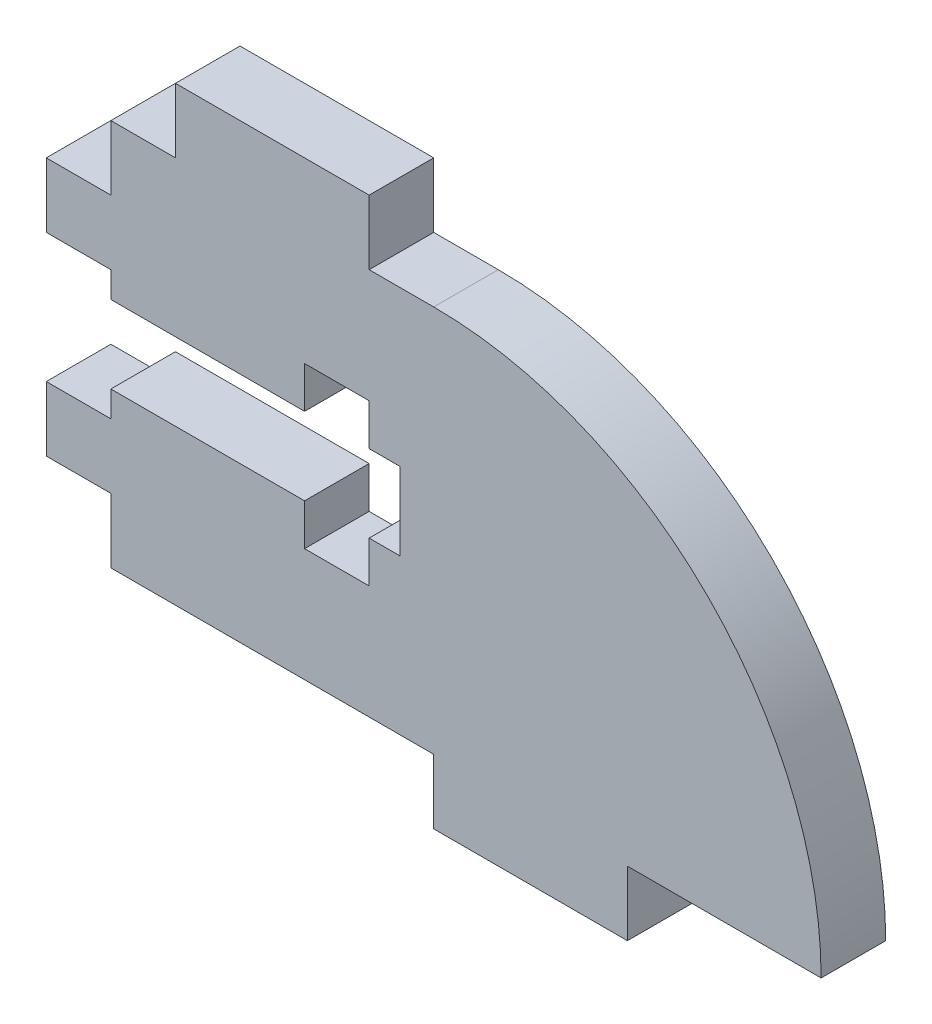
ISO-10303-21;
HEADER;
FILE_DESCRIPTION(('STEP AP214'),'2;1');
FILE_NAME('part.step','',(''),(''),'','','');
FILE_SCHEMA(('AUTOMOTIVE_DESIGN { 1 0 10303 214 1 1 1 1 }'));
ENDSEC;
DATA;
#1=APPLICATION_CONTEXT('core data for automotive mechanical design processes');
#2=APPLICATION_PROTOCOL_DEFINITION('international standard','automotive_design',2000,#1);
#3=PRODUCT_CONTEXT('',#1,'mechanical');
#4=PRODUCT('Part','Part','',(#3));
#5=PRODUCT_RELATED_PRODUCT_CATEGORY('part','',(#4));
#6=PRODUCT_DEFINITION_FORMATION('','',#4);
#7=PRODUCT_DEFINITION_CONTEXT('part definition',#1,'design');
#8=PRODUCT_DEFINITION('design','',#6,#7);
#9=PRODUCT_DEFINITION_SHAPE('','',#8);
#10=(LENGTH_UNIT() NAMED_UNIT(*) SI_UNIT(.MILLI.,.METRE.));
#11=(NAMED_UNIT(*) PLANE_ANGLE_UNIT() SI_UNIT($,.RADIAN.));
#12=(NAMED_UNIT(*) SI_UNIT($,.STERADIAN.) SOLID_ANGLE_UNIT());
#13=UNCERTAINTY_MEASURE_WITH_UNIT(LENGTH_MEASURE(1.E-05),#10,'distance_accuracy_value','');
#14=(GEOMETRIC_REPRESENTATION_CONTEXT(3) GLOBAL_UNCERTAINTY_ASSIGNED_CONTEXT((#13)) GLOBAL_UNIT_ASSIGNED_CONTEXT((#10,
#11,#12)) REPRESENTATION_CONTEXT('',''));
#15=CARTESIAN_POINT('',(0.,0.,0.));
#16=DIRECTION('',(0.,0.,1.));
#17=DIRECTION('',(1.,0.,0.));
#18=AXIS2_PLACEMENT_3D('',#15,#16,#17);
#19=CARTESIAN_POINT('',(0.,0.,3.175));
#20=DIRECTION('',(0.,1.,0.));
#21=DIRECTION('',(0.,0.,1.));
#22=AXIS2_PLACEMENT_3D('',#19,#20,#21);
#23=PLANE('',#22);
#24=DIRECTION('',(1.,0.,0.));
#25=VECTOR('',#24,1.);
#26=CARTESIAN_POINT('',(0.,0.,0.));
#27=LINE('',#26,#25);
#28=CARTESIAN_POINT('',(0.,0.,0.));
#29=VERTEX_POINT('',#28);
#30=CARTESIAN_POINT('',(15.875,0.,0.));
#31=VERTEX_POINT('',#30);
#32=EDGE_CURVE('E273',#29,#31,#27,.T.);
#33=ORIENTED_EDGE('',*,*,#32,.T.);
#34=DIRECTION('',(0.,0.,-1.));
#35=VECTOR('',#34,1.);
#36=CARTESIAN_POINT('',(15.875,0.,3.175));
#37=LINE('',#36,#35);
#38=CARTESIAN_POINT('',(15.875,0.,3.175));
#39=VERTEX_POINT('',#38);
#40=EDGE_CURVE('E11',#39,#31,#37,.T.);
#41=ORIENTED_EDGE('',*,*,#40,.F.);
#42=DIRECTION('',(1.,0.,0.));
#43=VECTOR('',#42,1.);
#44=CARTESIAN_POINT('',(0.,0.,3.175));
#45=LINE('',#44,#43);
#46=CARTESIAN_POINT('',(0.,0.,3.175));
#47=VERTEX_POINT('',#46);
#48=EDGE_CURVE('E335',#47,#39,#45,.T.);
#49=ORIENTED_EDGE('',*,*,#48,.F.);
#50=DIRECTION('',(0.,0.,-1.));
#51=VECTOR('',#50,1.);
#52=CARTESIAN_POINT('',(0.,0.,3.175));
#53=LINE('',#52,#51);
#54=EDGE_CURVE('E269',#47,#29,#53,.T.);
#55=ORIENTED_EDGE('',*,*,#54,.T.);
#56=EDGE_LOOP('',(#33,#41,#49,#55));
#57=FACE_BOUND('',#56,.T.);
#58=ADVANCED_FACE('F33',(#57),#23,.F.);
#59=CARTESIAN_POINT('',(15.875,0.,3.175));
#60=DIRECTION('',(1.,0.,0.));
#61=DIRECTION('',(0.,0.,-1.));
#62=AXIS2_PLACEMENT_3D('',#59,#60,#61);
#63=PLANE('',#62);
#64=DIRECTION('',(0.,-1.,0.));
#65=VECTOR('',#64,1.);
#66=CARTESIAN_POINT('',(15.875,0.,0.));
#67=LINE('',#66,#65);
#68=CARTESIAN_POINT('',(15.875,-3.175,0.));
#69=VERTEX_POINT('',#68);
#70=EDGE_CURVE('E276',#31,#69,#67,.T.);
#71=ORIENTED_EDGE('',*,*,#70,.T.);
#72=DIRECTION('',(0.,0.,-1.));
#73=VECTOR('',#72,1.);
#74=CARTESIAN_POINT('',(15.875,-3.175,3.175));
#75=LINE('',#74,#73);
#76=CARTESIAN_POINT('',(15.875,-3.175,3.175));
#77=VERTEX_POINT('',#76);
#78=EDGE_CURVE('E41',#77,#69,#75,.T.);
#79=ORIENTED_EDGE('',*,*,#78,.F.);
#80=DIRECTION('',(0.,-1.,0.));
#81=VECTOR('',#80,1.);
#82=CARTESIAN_POINT('',(15.875,0.,3.175));
#83=LINE('',#82,#81);
#84=EDGE_CURVE('E164',#39,#77,#83,.T.);
#85=ORIENTED_EDGE('',*,*,#84,.F.);
#86=ORIENTED_EDGE('',*,*,#40,.T.);
#87=EDGE_LOOP('',(#71,#79,#85,#86));
#88=FACE_BOUND('',#87,.T.);
#89=ADVANCED_FACE('F513',(#88),#63,.F.);
#90=CARTESIAN_POINT('',(15.875,-3.175,3.175));
#91=DIRECTION('',(0.,1.,0.));
#92=DIRECTION('',(-1.,0.,0.));
#93=AXIS2_PLACEMENT_3D('',#90,#91,#92);
#94=PLANE('',#93);
#95=DIRECTION('',(1.,0.,0.));
#96=VECTOR('',#95,1.);
#97=CARTESIAN_POINT('',(15.875,-3.175,0.));
#98=LINE('',#97,#96);
#99=CARTESIAN_POINT('',(25.4,-3.175,0.));
#100=VERTEX_POINT('',#99);
#101=EDGE_CURVE('E278',#69,#100,#98,.T.);
#102=ORIENTED_EDGE('',*,*,#101,.T.);
#103=DIRECTION('',(0.,0.,-1.));
#104=VECTOR('',#103,1.);
#105=CARTESIAN_POINT('',(25.4,-3.175,3.175));
#106=LINE('',#105,#104);
#107=CARTESIAN_POINT('',(25.4,-3.175,3.175));
#108=VERTEX_POINT('',#107);
#109=EDGE_CURVE('E414',#108,#100,#106,.T.);
#110=ORIENTED_EDGE('',*,*,#109,.F.);
#111=DIRECTION('',(1.,0.,0.));
#112=VECTOR('',#111,1.);
#113=CARTESIAN_POINT('',(15.875,-3.175,3.175));
#114=LINE('',#113,#112);
#115=EDGE_CURVE('E422',#77,#108,#114,.T.);
#116=ORIENTED_EDGE('',*,*,#115,.F.);
#117=ORIENTED_EDGE('',*,*,#78,.T.);
#118=EDGE_LOOP('',(#102,#110,#116,#117));
#119=FACE_BOUND('',#118,.T.);
#120=ADVANCED_FACE('F420',(#119),#94,.F.);
#121=CARTESIAN_POINT('',(25.4,-3.175,3.175));
#122=DIRECTION('',(-1.,0.,0.));
#123=DIRECTION('',(0.,0.,1.));
#124=AXIS2_PLACEMENT_3D('',#121,#122,#123);
#125=PLANE('',#124);
#126=DIRECTION('',(0.,1.,0.));
#127=VECTOR('',#126,1.);
#128=CARTESIAN_POINT('',(25.4,-3.175,0.));
#129=LINE('',#128,#127);
#130=CARTESIAN_POINT('',(25.4,0.,0.));
#131=VERTEX_POINT('',#130);
#132=EDGE_CURVE('E280',#100,#131,#129,.T.);
#133=ORIENTED_EDGE('',*,*,#132,.T.);
#134=DIRECTION('',(0.,0.,-1.));
#135=VECTOR('',#134,1.);
#136=CARTESIAN_POINT('',(25.4,0.,3.175));
#137=LINE('',#136,#135);
#138=CARTESIAN_POINT('',(25.4,0.,3.175));
#139=VERTEX_POINT('',#138);
#140=EDGE_CURVE('E411',#139,#131,#137,.T.);
#141=ORIENTED_EDGE('',*,*,#140,.F.);
#142=DIRECTION('',(0.,1.,0.));
#143=VECTOR('',#142,1.);
#144=CARTESIAN_POINT('',(25.4,-3.175,3.175));
#145=LINE('',#144,#143);
#146=EDGE_CURVE('E440',#108,#139,#145,.T.);
#147=ORIENTED_EDGE('',*,*,#146,.F.);
#148=ORIENTED_EDGE('',*,*,#109,.T.);
#149=EDGE_LOOP('',(#133,#141,#147,#148));
#150=FACE_BOUND('',#149,.T.);
#151=ADVANCED_FACE('F431',(#150),#125,.F.);
#152=CARTESIAN_POINT('',(25.4,0.,3.175));
#153=DIRECTION('',(0.,1.,0.));
#154=DIRECTION('',(0.,0.,1.));
#155=AXIS2_PLACEMENT_3D('',#152,#153,#154);
#156=PLANE('',#155);
#157=DIRECTION('',(1.,0.,0.));
#158=VECTOR('',#157,1.);
#159=CARTESIAN_POINT('',(25.4,0.,0.));
#160=LINE('',#159,#158);
#161=CARTESIAN_POINT('',(34.925,0.,0.));
#162=VERTEX_POINT('',#161);
#163=EDGE_CURVE('E282',#131,#162,#160,.T.);
#164=ORIENTED_EDGE('',*,*,#163,.T.);
#165=DIRECTION('',(0.,0.,-1.));
#166=VECTOR('',#165,1.);
#167=CARTESIAN_POINT('',(34.925,0.,3.175));
#168=LINE('',#167,#166);
#169=CARTESIAN_POINT('',(34.925,0.,3.175));
#170=VERTEX_POINT('',#169);
#171=EDGE_CURVE('E408',#170,#162,#168,.T.);
#172=ORIENTED_EDGE('',*,*,#171,.F.);
#173=DIRECTION('',(1.,0.,0.));
#174=VECTOR('',#173,1.);
#175=CARTESIAN_POINT('',(25.4,0.,3.175));
#176=LINE('',#175,#174);
#177=EDGE_CURVE('E437',#139,#170,#176,.T.);
#178=ORIENTED_EDGE('',*,*,#177,.F.);
#179=ORIENTED_EDGE('',*,*,#140,.T.);
#180=EDGE_LOOP('',(#164,#172,#178,#179));
#181=FACE_BOUND('',#180,.T.);
#182=ADVANCED_FACE('F435',(#181),#156,.F.);
#183=CARTESIAN_POINT('',(15.875,0.,3.175));
#184=DIRECTION('',(0.,0.,-1.));
#185=DIRECTION('',(-1.,0.,0.));
#186=AXIS2_PLACEMENT_3D('',#183,#184,#185);
#187=CYLINDRICAL_SURFACE('',#186,19.05);
#188=CARTESIAN_POINT('',(15.875,0.,0.));
#189=DIRECTION('',(0.,0.,1.));
#190=DIRECTION('',(-1.,0.,0.));
#191=AXIS2_PLACEMENT_3D('',#188,#189,#190);
#192=CIRCLE('',#191,19.05);
#193=CARTESIAN_POINT('',(15.875,19.05,0.));
#194=VERTEX_POINT('',#193);
#195=EDGE_CURVE('E284',#162,#194,#192,.T.);
#196=ORIENTED_EDGE('',*,*,#195,.T.);
#197=DIRECTION('',(0.,0.,-1.));
#198=VECTOR('',#197,1.);
#199=CARTESIAN_POINT('',(15.875,19.05,3.175));
#200=LINE('',#199,#198);
#201=CARTESIAN_POINT('',(15.875,19.05,3.175));
#202=VERTEX_POINT('',#201);
#203=EDGE_CURVE('E405',#202,#194,#200,.T.);
#204=ORIENTED_EDGE('',*,*,#203,.F.);
#205=CARTESIAN_POINT('',(15.875,0.,3.175));
#206=DIRECTION('',(0.,0.,1.));
#207=DIRECTION('',(-1.,0.,0.));
#208=AXIS2_PLACEMENT_3D('',#205,#206,#207);
#209=CIRCLE('',#208,19.05);
#210=EDGE_CURVE('E439',#170,#202,#209,.T.);
#211=ORIENTED_EDGE('',*,*,#210,.F.);
#212=ORIENTED_EDGE('',*,*,#171,.T.);
#213=EDGE_LOOP('',(#196,#204,#211,#212));
#214=FACE_BOUND('',#213,.T.);
#215=ADVANCED_FACE('F526',(#214),#187,.T.);
#216=CARTESIAN_POINT('',(12.7,19.05,3.175));
#217=DIRECTION('',(0.,-1.,0.));
#218=DIRECTION('',(0.,0.,-1.));
#219=AXIS2_PLACEMENT_3D('',#216,#217,#218);
#220=PLANE('',#219);
#221=DIRECTION('',(-1.,0.,0.));
#222=VECTOR('',#221,1.);
#223=CARTESIAN_POINT('',(12.7,19.05,0.));
#224=LINE('',#223,#222);
#225=CARTESIAN_POINT('',(12.7,19.05,0.));
#226=VERTEX_POINT('',#225);
#227=EDGE_CURVE('E286',#194,#226,#224,.T.);
#228=ORIENTED_EDGE('',*,*,#227,.T.);
#229=DIRECTION('',(0.,0.,-1.));
#230=VECTOR('',#229,1.);
#231=CARTESIAN_POINT('',(12.7,19.05,3.175));
#232=LINE('',#231,#230);
#233=CARTESIAN_POINT('',(12.7,19.05,3.175));
#234=VERTEX_POINT('',#233);
#235=EDGE_CURVE('E402',#234,#226,#232,.T.);
#236=ORIENTED_EDGE('',*,*,#235,.F.);
#237=DIRECTION('',(-1.,0.,0.));
#238=VECTOR('',#237,1.);
#239=CARTESIAN_POINT('',(12.7,19.05,3.175));
#240=LINE('',#239,#238);
#241=EDGE_CURVE('E442',#202,#234,#240,.T.);
#242=ORIENTED_EDGE('',*,*,#241,.F.);
#243=ORIENTED_EDGE('',*,*,#203,.T.);
#244=EDGE_LOOP('',(#228,#236,#242,#243));
#245=FACE_BOUND('',#244,.T.);
#246=ADVANCED_FACE('F529',(#245),#220,.F.);
#247=CARTESIAN_POINT('',(12.7,22.225,3.175));
#248=DIRECTION('',(-1.,0.,0.));
#249=DIRECTION('',(0.,-1.,0.));
#250=AXIS2_PLACEMENT_3D('',#247,#248,#249);
#251=PLANE('',#250);
#252=DIRECTION('',(0.,1.,0.));
#253=VECTOR('',#252,1.);
#254=CARTESIAN_POINT('',(12.7,22.225,0.));
#255=LINE('',#254,#253);
#256=CARTESIAN_POINT('',(12.7,22.225,0.));
#257=VERTEX_POINT('',#256);
#258=EDGE_CURVE('E288',#226,#257,#255,.T.);
#259=ORIENTED_EDGE('',*,*,#258,.T.);
#260=DIRECTION('',(0.,0.,-1.));
#261=VECTOR('',#260,1.);
#262=CARTESIAN_POINT('',(12.7,22.225,3.175));
#263=LINE('',#262,#261);
#264=CARTESIAN_POINT('',(12.7,22.225,3.175));
#265=VERTEX_POINT('',#264);
#266=EDGE_CURVE('E399',#265,#257,#263,.T.);
#267=ORIENTED_EDGE('',*,*,#266,.F.);
#268=DIRECTION('',(0.,1.,0.));
#269=VECTOR('',#268,1.);
#270=CARTESIAN_POINT('',(12.7,22.225,3.175));
#271=LINE('',#270,#269);
#272=EDGE_CURVE('E448',#234,#265,#271,.T.);
#273=ORIENTED_EDGE('',*,*,#272,.F.);
#274=ORIENTED_EDGE('',*,*,#235,.T.);
#275=EDGE_LOOP('',(#259,#267,#273,#274));
#276=FACE_BOUND('',#275,.T.);
#277=ADVANCED_FACE('F533',(#276),#251,.F.);
#278=CARTESIAN_POINT('',(3.175,22.225,3.175));
#279=DIRECTION('',(0.,-1.,0.));
#280=DIRECTION('',(0.,0.,-1.));
#281=AXIS2_PLACEMENT_3D('',#278,#279,#280);
#282=PLANE('',#281);
#283=DIRECTION('',(-1.,0.,0.));
#284=VECTOR('',#283,1.);
#285=CARTESIAN_POINT('',(3.175,22.225,0.));
#286=LINE('',#285,#284);
#287=CARTESIAN_POINT('',(3.175,22.225,0.));
#288=VERTEX_POINT('',#287);
#289=EDGE_CURVE('E290',#257,#288,#286,.T.);
#290=ORIENTED_EDGE('',*,*,#289,.T.);
#291=DIRECTION('',(0.,0.,-1.));
#292=VECTOR('',#291,1.);
#293=CARTESIAN_POINT('',(3.175,22.225,3.175));
#294=LINE('',#293,#292);
#295=CARTESIAN_POINT('',(3.175,22.225,3.175));
#296=VERTEX_POINT('',#295);
#297=EDGE_CURVE('E396',#296,#288,#294,.T.);
#298=ORIENTED_EDGE('',*,*,#297,.F.);
#299=DIRECTION('',(-1.,0.,0.));
#300=VECTOR('',#299,1.);
#301=CARTESIAN_POINT('',(3.175,22.225,3.175));
#302=LINE('',#301,#300);
#303=EDGE_CURVE('E450',#265,#296,#302,.T.);
#304=ORIENTED_EDGE('',*,*,#303,.F.);
#305=ORIENTED_EDGE('',*,*,#266,.T.);
#306=EDGE_LOOP('',(#290,#298,#304,#305));
#307=FACE_BOUND('',#306,.T.);
#308=ADVANCED_FACE('F537',(#307),#282,.F.);
#309=CARTESIAN_POINT('',(3.175,19.05,3.175));
#310=DIRECTION('',(1.,0.,0.));
#311=DIRECTION('',(0.,0.,-1.));
#312=AXIS2_PLACEMENT_3D('',#309,#310,#311);
#313=PLANE('',#312);
#314=DIRECTION('',(0.,-1.,0.));
#315=VECTOR('',#314,1.);
#316=CARTESIAN_POINT('',(3.175,19.05,0.));
#317=LINE('',#316,#315);
#318=CARTESIAN_POINT('',(3.175,19.05,0.));
#319=VERTEX_POINT('',#318);
#320=EDGE_CURVE('E292',#288,#319,#317,.T.);
#321=ORIENTED_EDGE('',*,*,#320,.T.);
#322=DIRECTION('',(0.,0.,-1.));
#323=VECTOR('',#322,1.);
#324=CARTESIAN_POINT('',(3.175,19.05,3.175));
#325=LINE('',#324,#323);
#326=CARTESIAN_POINT('',(3.175,19.05,3.175));
#327=VERTEX_POINT('',#326);
#328=EDGE_CURVE('E393',#327,#319,#325,.T.);
#329=ORIENTED_EDGE('',*,*,#328,.F.);
#330=DIRECTION('',(0.,-1.,0.));
#331=VECTOR('',#330,1.);
#332=CARTESIAN_POINT('',(3.175,19.05,3.175));
#333=LINE('',#332,#331);
#334=EDGE_CURVE('E452',#296,#327,#333,.T.);
#335=ORIENTED_EDGE('',*,*,#334,.F.);
#336=ORIENTED_EDGE('',*,*,#297,.T.);
#337=EDGE_LOOP('',(#321,#329,#335,#336));
#338=FACE_BOUND('',#337,.T.);
#339=ADVANCED_FACE('F541',(#338),#313,.F.);
#340=CARTESIAN_POINT('',(0.,19.05,3.175));
#341=DIRECTION('',(0.,-1.,0.));
#342=DIRECTION('',(0.,0.,-1.));
#343=AXIS2_PLACEMENT_3D('',#340,#341,#342);
#344=PLANE('',#343);
#345=DIRECTION('',(-1.,0.,0.));
#346=VECTOR('',#345,1.);
#347=CARTESIAN_POINT('',(0.,19.05,0.));
#348=LINE('',#347,#346);
#349=CARTESIAN_POINT('',(0.,19.05,0.));
#350=VERTEX_POINT('',#349);
#351=EDGE_CURVE('E294',#319,#350,#348,.T.);
#352=ORIENTED_EDGE('',*,*,#351,.T.);
#353=DIRECTION('',(0.,0.,-1.));
#354=VECTOR('',#353,1.);
#355=CARTESIAN_POINT('',(0.,19.05,3.175));
#356=LINE('',#355,#354);
#357=CARTESIAN_POINT('',(0.,19.05,3.175));
#358=VERTEX_POINT('',#357);
#359=EDGE_CURVE('E390',#358,#350,#356,.T.);
#360=ORIENTED_EDGE('',*,*,#359,.F.);
#361=DIRECTION('',(-1.,0.,0.));
#362=VECTOR('',#361,1.);
#363=CARTESIAN_POINT('',(0.,19.05,3.175));
#364=LINE('',#363,#362);
#365=EDGE_CURVE('E454',#327,#358,#364,.T.);
#366=ORIENTED_EDGE('',*,*,#365,.F.);
#367=ORIENTED_EDGE('',*,*,#328,.T.);
#368=EDGE_LOOP('',(#352,#360,#366,#367));
#369=FACE_BOUND('',#368,.T.);
#370=ADVANCED_FACE('F545',(#369),#344,.F.);
#371=CARTESIAN_POINT('',(0.,15.875,3.175));
#372=DIRECTION('',(1.,0.,0.));
#373=DIRECTION('',(0.,0.,-1.));
#374=AXIS2_PLACEMENT_3D('',#371,#372,#373);
#375=PLANE('',#374);
#376=DIRECTION('',(0.,-1.,0.));
#377=VECTOR('',#376,1.);
#378=CARTESIAN_POINT('',(0.,15.875,0.));
#379=LINE('',#378,#377);
#380=CARTESIAN_POINT('',(0.,15.875,0.));
#381=VERTEX_POINT('',#380);
#382=EDGE_CURVE('E296',#350,#381,#379,.T.);
#383=ORIENTED_EDGE('',*,*,#382,.T.);
#384=DIRECTION('',(0.,0.,-1.));
#385=VECTOR('',#384,1.);
#386=CARTESIAN_POINT('',(0.,15.875,3.175));
#387=LINE('',#386,#385);
#388=CARTESIAN_POINT('',(0.,15.875,3.175));
#389=VERTEX_POINT('',#388);
#390=EDGE_CURVE('E387',#389,#381,#387,.T.);
#391=ORIENTED_EDGE('',*,*,#390,.F.);
#392=DIRECTION('',(0.,-1.,0.));
#393=VECTOR('',#392,1.);
#394=CARTESIAN_POINT('',(0.,15.875,3.175));
#395=LINE('',#394,#393);
#396=EDGE_CURVE('E456',#358,#389,#395,.T.);
#397=ORIENTED_EDGE('',*,*,#396,.F.);
#398=ORIENTED_EDGE('',*,*,#359,.T.);
#399=EDGE_LOOP('',(#383,#391,#397,#398));
#400=FACE_BOUND('',#399,.T.);
#401=ADVANCED_FACE('F549',(#400),#375,.F.);
#402=CARTESIAN_POINT('',(-3.175,15.875,3.175));
#403=DIRECTION('',(0.,-1.,0.));
#404=DIRECTION('',(0.,0.,-1.));
#405=AXIS2_PLACEMENT_3D('',#402,#403,#404);
#406=PLANE('',#405);
#407=DIRECTION('',(-1.,0.,0.));
#408=VECTOR('',#407,1.);
#409=CARTESIAN_POINT('',(-3.175,15.875,0.));
#410=LINE('',#409,#408);
#411=CARTESIAN_POINT('',(-3.175,15.875,0.));
#412=VERTEX_POINT('',#411);
#413=EDGE_CURVE('E298',#381,#412,#410,.T.);
#414=ORIENTED_EDGE('',*,*,#413,.T.);
#415=DIRECTION('',(0.,0.,-1.));
#416=VECTOR('',#415,1.);
#417=CARTESIAN_POINT('',(-3.175,15.875,3.175));
#418=LINE('',#417,#416);
#419=CARTESIAN_POINT('',(-3.175,15.875,3.175));
#420=VERTEX_POINT('',#419);
#421=EDGE_CURVE('E384',#420,#412,#418,.T.);
#422=ORIENTED_EDGE('',*,*,#421,.F.);
#423=DIRECTION('',(-1.,0.,0.));
#424=VECTOR('',#423,1.);
#425=CARTESIAN_POINT('',(-3.175,15.875,3.175));
#426=LINE('',#425,#424);
#427=EDGE_CURVE('E458',#389,#420,#426,.T.);
#428=ORIENTED_EDGE('',*,*,#427,.F.);
#429=ORIENTED_EDGE('',*,*,#390,.T.);
#430=EDGE_LOOP('',(#414,#422,#428,#429));
#431=FACE_BOUND('',#430,.T.);
#432=ADVANCED_FACE('F553',(#431),#406,.F.);
#433=CARTESIAN_POINT('',(-3.175,12.7,3.175));
#434=DIRECTION('',(1.,0.,0.));
#435=DIRECTION('',(0.,0.,-1.));
#436=AXIS2_PLACEMENT_3D('',#433,#434,#435);
#437=PLANE('',#436);
#438=DIRECTION('',(0.,-1.,0.));
#439=VECTOR('',#438,1.);
#440=CARTESIAN_POINT('',(-3.175,12.7,0.));
#441=LINE('',#440,#439);
#442=CARTESIAN_POINT('',(-3.175,12.7,0.));
#443=VERTEX_POINT('',#442);
#444=EDGE_CURVE('E300',#412,#443,#441,.T.);
#445=ORIENTED_EDGE('',*,*,#444,.T.);
#446=DIRECTION('',(0.,0.,-1.));
#447=VECTOR('',#446,1.);
#448=CARTESIAN_POINT('',(-3.175,12.7,3.175));
#449=LINE('',#448,#447);
#450=CARTESIAN_POINT('',(-3.175,12.7,3.175));
#451=VERTEX_POINT('',#450);
#452=EDGE_CURVE('E381',#451,#443,#449,.T.);
#453=ORIENTED_EDGE('',*,*,#452,.F.);
#454=DIRECTION('',(0.,-1.,0.));
#455=VECTOR('',#454,1.);
#456=CARTESIAN_POINT('',(-3.175,12.7,3.175));
#457=LINE('',#456,#455);
#458=EDGE_CURVE('E460',#420,#451,#457,.T.);
#459=ORIENTED_EDGE('',*,*,#458,.F.);
#460=ORIENTED_EDGE('',*,*,#421,.T.);
#461=EDGE_LOOP('',(#445,#453,#459,#460));
#462=FACE_BOUND('',#461,.T.);
#463=ADVANCED_FACE('F557',(#462),#437,.F.);
#464=CARTESIAN_POINT('',(0.,12.7,3.175));
#465=DIRECTION('',(0.,1.,0.));
#466=DIRECTION('',(0.,0.,1.));
#467=AXIS2_PLACEMENT_3D('',#464,#465,#466);
#468=PLANE('',#467);
#469=DIRECTION('',(1.,0.,0.));
#470=VECTOR('',#469,1.);
#471=CARTESIAN_POINT('',(0.,12.7,0.));
#472=LINE('',#471,#470);
#473=CARTESIAN_POINT('',(0.,12.7,0.));
#474=VERTEX_POINT('',#473);
#475=EDGE_CURVE('E302',#443,#474,#472,.T.);
#476=ORIENTED_EDGE('',*,*,#475,.T.);
#477=DIRECTION('',(0.,0.,-1.));
#478=VECTOR('',#477,1.);
#479=CARTESIAN_POINT('',(0.,12.7,3.175));
#480=LINE('',#479,#478);
#481=CARTESIAN_POINT('',(0.,12.7,3.175));
#482=VERTEX_POINT('',#481);
#483=EDGE_CURVE('E378',#482,#474,#480,.T.);
#484=ORIENTED_EDGE('',*,*,#483,.F.);
#485=DIRECTION('',(1.,0.,0.));
#486=VECTOR('',#485,1.);
#487=CARTESIAN_POINT('',(0.,12.7,3.175));
#488=LINE('',#487,#486);
#489=EDGE_CURVE('E462',#451,#482,#488,.T.);
#490=ORIENTED_EDGE('',*,*,#489,.F.);
#491=ORIENTED_EDGE('',*,*,#452,.T.);
#492=EDGE_LOOP('',(#476,#484,#490,#491));
#493=FACE_BOUND('',#492,.T.);
#494=ADVANCED_FACE('F561',(#493),#468,.F.);
#495=CARTESIAN_POINT('',(0.,11.43,3.175));
#496=DIRECTION('',(1.,0.,0.));
#497=DIRECTION('',(0.,0.,-1.));
#498=AXIS2_PLACEMENT_3D('',#495,#496,#497);
#499=PLANE('',#498);
#500=DIRECTION('',(0.,-1.,0.));
#501=VECTOR('',#500,1.);
#502=CARTESIAN_POINT('',(0.,11.43,0.));
#503=LINE('',#502,#501);
#504=CARTESIAN_POINT('',(0.,11.43,0.));
#505=VERTEX_POINT('',#504);
#506=EDGE_CURVE('E304',#474,#505,#503,.T.);
#507=ORIENTED_EDGE('',*,*,#506,.T.);
#508=DIRECTION('',(0.,0.,-1.));
#509=VECTOR('',#508,1.);
#510=CARTESIAN_POINT('',(0.,11.43,3.175));
#511=LINE('',#510,#509);
#512=CARTESIAN_POINT('',(0.,11.43,3.175));
#513=VERTEX_POINT('',#512);
#514=EDGE_CURVE('E375',#513,#505,#511,.T.);
#515=ORIENTED_EDGE('',*,*,#514,.F.);
#516=DIRECTION('',(0.,-1.,0.));
#517=VECTOR('',#516,1.);
#518=CARTESIAN_POINT('',(0.,11.43,3.175));
#519=LINE('',#518,#517);
#520=EDGE_CURVE('E464',#482,#513,#519,.T.);
#521=ORIENTED_EDGE('',*,*,#520,.F.);
#522=ORIENTED_EDGE('',*,*,#483,.T.);
#523=EDGE_LOOP('',(#507,#515,#521,#522));
#524=FACE_BOUND('',#523,.T.);
#525=ADVANCED_FACE('F565',(#524),#499,.F.);
#526=CARTESIAN_POINT('',(0.,11.43,3.175));
#527=DIRECTION('',(0.,1.,0.));
#528=DIRECTION('',(0.,0.,1.));
#529=AXIS2_PLACEMENT_3D('',#526,#527,#528);
#530=PLANE('',#529);
#531=DIRECTION('',(1.,0.,0.));
#532=VECTOR('',#531,1.);
#533=CARTESIAN_POINT('',(0.,11.43,0.));
#534=LINE('',#533,#532);
#535=CARTESIAN_POINT('',(9.525,11.43,0.));
#536=VERTEX_POINT('',#535);
#537=EDGE_CURVE('E306',#505,#536,#534,.T.);
#538=ORIENTED_EDGE('',*,*,#537,.T.);
#539=DIRECTION('',(0.,0.,-1.));
#540=VECTOR('',#539,1.);
#541=CARTESIAN_POINT('',(9.525,11.43,3.175));
#542=LINE('',#541,#540);
#543=CARTESIAN_POINT('',(9.525,11.43,3.175));
#544=VERTEX_POINT('',#543);
#545=EDGE_CURVE('E372',#544,#536,#542,.T.);
#546=ORIENTED_EDGE('',*,*,#545,.F.);
#547=DIRECTION('',(1.,0.,0.));
#548=VECTOR('',#547,1.);
#549=CARTESIAN_POINT('',(0.,11.43,3.175));
#550=LINE('',#549,#548);
#551=EDGE_CURVE('E466',#513,#544,#550,.T.);
#552=ORIENTED_EDGE('',*,*,#551,.F.);
#553=ORIENTED_EDGE('',*,*,#514,.T.);
#554=EDGE_LOOP('',(#538,#546,#552,#553));
#555=FACE_BOUND('',#554,.T.);
#556=ADVANCED_FACE('F569',(#555),#530,.F.);
#557=CARTESIAN_POINT('',(9.525,11.43,3.175));
#558=DIRECTION('',(-1.,0.,0.));
#559=DIRECTION('',(0.,0.,1.));
#560=AXIS2_PLACEMENT_3D('',#557,#558,#559);
#561=PLANE('',#560);
#562=DIRECTION('',(0.,1.,0.));
#563=VECTOR('',#562,1.);
#564=CARTESIAN_POINT('',(9.525,11.43,0.));
#565=LINE('',#564,#563);
#566=CARTESIAN_POINT('',(9.525,13.4675222512806,0.));
#567=VERTEX_POINT('',#566);
#568=EDGE_CURVE('E308',#536,#567,#565,.T.);
#569=ORIENTED_EDGE('',*,*,#568,.T.);
#570=DIRECTION('',(0.,0.,-1.));
#571=VECTOR('',#570,1.);
#572=CARTESIAN_POINT('',(9.525,13.4675222512806,3.175));
#573=LINE('',#572,#571);
#574=CARTESIAN_POINT('',(9.525,13.4675222512806,3.175));
#575=VERTEX_POINT('',#574);
#576=EDGE_CURVE('E369',#575,#567,#573,.T.);
#577=ORIENTED_EDGE('',*,*,#576,.F.);
#578=DIRECTION('',(0.,1.,0.));
#579=VECTOR('',#578,1.);
#580=CARTESIAN_POINT('',(9.525,11.43,3.175));
#581=LINE('',#580,#579);
#582=EDGE_CURVE('E468',#544,#575,#581,.T.);
#583=ORIENTED_EDGE('',*,*,#582,.F.);
#584=ORIENTED_EDGE('',*,*,#545,.T.);
#585=EDGE_LOOP('',(#569,#577,#583,#584));
#586=FACE_BOUND('',#585,.T.);
#587=ADVANCED_FACE('F573',(#586),#561,.F.);
#588=CARTESIAN_POINT('',(9.525,13.4675222512806,3.175));
#589=DIRECTION('',(0.,1.,0.));
#590=DIRECTION('',(-1.,0.,0.));
#591=AXIS2_PLACEMENT_3D('',#588,#589,#590);
#592=PLANE('',#591);
#593=DIRECTION('',(1.,0.,0.));
#594=VECTOR('',#593,1.);
#595=CARTESIAN_POINT('',(9.525,13.4675222512806,0.));
#596=LINE('',#595,#594);
#597=CARTESIAN_POINT('',(12.7,13.4675222512806,0.));
#598=VERTEX_POINT('',#597);
#599=EDGE_CURVE('E310',#567,#598,#596,.T.);
#600=ORIENTED_EDGE('',*,*,#599,.T.);
#601=DIRECTION('',(0.,0.,-1.));
#602=VECTOR('',#601,1.);
#603=CARTESIAN_POINT('',(12.7,13.4675222512806,3.175));
#604=LINE('',#603,#602);
#605=CARTESIAN_POINT('',(12.7,13.4675222512806,3.175));
#606=VERTEX_POINT('',#605);
#607=EDGE_CURVE('E366',#606,#598,#604,.T.);
#608=ORIENTED_EDGE('',*,*,#607,.F.);
#609=DIRECTION('',(1.,0.,0.));
#610=VECTOR('',#609,1.);
#611=CARTESIAN_POINT('',(9.525,13.4675222512806,3.175));
#612=LINE('',#611,#610);
#613=EDGE_CURVE('E470',#575,#606,#612,.T.);
#614=ORIENTED_EDGE('',*,*,#613,.F.);
#615=ORIENTED_EDGE('',*,*,#576,.T.);
#616=EDGE_LOOP('',(#600,#608,#614,#615));
#617=FACE_BOUND('',#616,.T.);
#618=ADVANCED_FACE('F577',(#617),#592,.F.);
#619=CARTESIAN_POINT('',(12.7,13.4675222512806,3.175));
#620=DIRECTION('',(1.,0.,0.));
#621=DIRECTION('',(0.,0.,-1.));
#622=AXIS2_PLACEMENT_3D('',#619,#620,#621);
#623=PLANE('',#622);
#624=DIRECTION('',(0.,-1.,0.));
#625=VECTOR('',#624,1.);
#626=CARTESIAN_POINT('',(12.7,13.4675222512806,0.));
#627=LINE('',#626,#625);
#628=CARTESIAN_POINT('',(12.7,11.43,0.));
#629=VERTEX_POINT('',#628);
#630=EDGE_CURVE('E312',#598,#629,#627,.T.);
#631=ORIENTED_EDGE('',*,*,#630,.T.);
#632=DIRECTION('',(0.,0.,-1.));
#633=VECTOR('',#632,1.);
#634=CARTESIAN_POINT('',(12.7,11.43,3.175));
#635=LINE('',#634,#633);
#636=CARTESIAN_POINT('',(12.7,11.43,3.175));
#637=VERTEX_POINT('',#636);
#638=EDGE_CURVE('E363',#637,#629,#635,.T.);
#639=ORIENTED_EDGE('',*,*,#638,.F.);
#640=DIRECTION('',(0.,-1.,0.));
#641=VECTOR('',#640,1.);
#642=CARTESIAN_POINT('',(12.7,13.4675222512806,3.175));
#643=LINE('',#642,#641);
#644=EDGE_CURVE('E472',#606,#637,#643,.T.);
#645=ORIENTED_EDGE('',*,*,#644,.F.);
#646=ORIENTED_EDGE('',*,*,#607,.T.);
#647=EDGE_LOOP('',(#631,#639,#645,#646));
#648=FACE_BOUND('',#647,.T.);
#649=ADVANCED_FACE('F581',(#648),#623,.F.);
#650=CARTESIAN_POINT('',(12.7,11.43,3.175));
#651=DIRECTION('',(0.,1.,0.));
#652=DIRECTION('',(0.,0.,1.));
#653=AXIS2_PLACEMENT_3D('',#650,#651,#652);
#654=PLANE('',#653);
#655=DIRECTION('',(1.,0.,0.));
#656=VECTOR('',#655,1.);
#657=CARTESIAN_POINT('',(12.7,11.43,0.));
#658=LINE('',#657,#656);
#659=CARTESIAN_POINT('',(14.224,11.43,0.));
#660=VERTEX_POINT('',#659);
#661=EDGE_CURVE('E314',#629,#660,#658,.T.);
#662=ORIENTED_EDGE('',*,*,#661,.T.);
#663=DIRECTION('',(0.,0.,-1.));
#664=VECTOR('',#663,1.);
#665=CARTESIAN_POINT('',(14.224,11.43,3.175));
#666=LINE('',#665,#664);
#667=CARTESIAN_POINT('',(14.224,11.43,3.175));
#668=VERTEX_POINT('',#667);
#669=EDGE_CURVE('E360',#668,#660,#666,.T.);
#670=ORIENTED_EDGE('',*,*,#669,.F.);
#671=DIRECTION('',(1.,0.,0.));
#672=VECTOR('',#671,1.);
#673=CARTESIAN_POINT('',(12.7,11.43,3.175));
#674=LINE('',#673,#672);
#675=EDGE_CURVE('E474',#637,#668,#674,.T.);
#676=ORIENTED_EDGE('',*,*,#675,.F.);
#677=ORIENTED_EDGE('',*,*,#638,.T.);
#678=EDGE_LOOP('',(#662,#670,#676,#677));
#679=FACE_BOUND('',#678,.T.);
#680=ADVANCED_FACE('F585',(#679),#654,.F.);
#681=CARTESIAN_POINT('',(14.224,11.43,3.175));
#682=DIRECTION('',(1.,0.,0.));
#683=DIRECTION('',(0.,0.,-1.));
#684=AXIS2_PLACEMENT_3D('',#681,#682,#683);
#685=PLANE('',#684);
#686=DIRECTION('',(0.,-1.,0.));
#687=VECTOR('',#686,1.);
#688=CARTESIAN_POINT('',(14.224,11.43,0.));
#689=LINE('',#688,#687);
#690=CARTESIAN_POINT('',(14.224,7.61999999999999,0.));
#691=VERTEX_POINT('',#690);
#692=EDGE_CURVE('E316',#660,#691,#689,.T.);
#693=ORIENTED_EDGE('',*,*,#692,.T.);
#694=DIRECTION('',(0.,0.,-1.));
#695=VECTOR('',#694,1.);
#696=CARTESIAN_POINT('',(14.224,7.61999999999999,3.175));
#697=LINE('',#696,#695);
#698=CARTESIAN_POINT('',(14.224,7.61999999999999,3.175));
#699=VERTEX_POINT('',#698);
#700=EDGE_CURVE('E357',#699,#691,#697,.T.);
#701=ORIENTED_EDGE('',*,*,#700,.F.);
#702=DIRECTION('',(0.,-1.,0.));
#703=VECTOR('',#702,1.);
#704=CARTESIAN_POINT('',(14.224,11.43,3.175));
#705=LINE('',#704,#703);
#706=EDGE_CURVE('E476',#668,#699,#705,.T.);
#707=ORIENTED_EDGE('',*,*,#706,.F.);
#708=ORIENTED_EDGE('',*,*,#669,.T.);
#709=EDGE_LOOP('',(#693,#701,#707,#708));
#710=FACE_BOUND('',#709,.T.);
#711=ADVANCED_FACE('F589',(#710),#685,.F.);
#712=CARTESIAN_POINT('',(12.7,7.61999999999999,3.175));
#713=DIRECTION('',(0.,-1.,0.));
#714=DIRECTION('',(0.,0.,-1.));
#715=AXIS2_PLACEMENT_3D('',#712,#713,#714);
#716=PLANE('',#715);
#717=DIRECTION('',(-1.,0.,0.));
#718=VECTOR('',#717,1.);
#719=CARTESIAN_POINT('',(12.7,7.61999999999999,0.));
#720=LINE('',#719,#718);
#721=CARTESIAN_POINT('',(12.7,7.61999999999999,0.));
#722=VERTEX_POINT('',#721);
#723=EDGE_CURVE('E318',#691,#722,#720,.T.);
#724=ORIENTED_EDGE('',*,*,#723,.T.);
#725=DIRECTION('',(0.,0.,-1.));
#726=VECTOR('',#725,1.);
#727=CARTESIAN_POINT('',(12.7,7.61999999999999,3.175));
#728=LINE('',#727,#726);
#729=CARTESIAN_POINT('',(12.7,7.61999999999999,3.175));
#730=VERTEX_POINT('',#729);
#731=EDGE_CURVE('E354',#730,#722,#728,.T.);
#732=ORIENTED_EDGE('',*,*,#731,.F.);
#733=DIRECTION('',(-1.,0.,0.));
#734=VECTOR('',#733,1.);
#735=CARTESIAN_POINT('',(12.7,7.61999999999999,3.175));
#736=LINE('',#735,#734);
#737=EDGE_CURVE('E478',#699,#730,#736,.T.);
#738=ORIENTED_EDGE('',*,*,#737,.F.);
#739=ORIENTED_EDGE('',*,*,#700,.T.);
#740=EDGE_LOOP('',(#724,#732,#738,#739));
#741=FACE_BOUND('',#740,.T.);
#742=ADVANCED_FACE('F593',(#741),#716,.F.);
#743=CARTESIAN_POINT('',(12.7,5.58247774871944,3.175));
#744=DIRECTION('',(1.,0.,0.));
#745=DIRECTION('',(0.,0.,-1.));
#746=AXIS2_PLACEMENT_3D('',#743,#744,#745);
#747=PLANE('',#746);
#748=DIRECTION('',(0.,-1.,0.));
#749=VECTOR('',#748,1.);
#750=CARTESIAN_POINT('',(12.7,5.58247774871944,0.));
#751=LINE('',#750,#749);
#752=CARTESIAN_POINT('',(12.7,5.58247774871944,0.));
#753=VERTEX_POINT('',#752);
#754=EDGE_CURVE('E320',#722,#753,#751,.T.);
#755=ORIENTED_EDGE('',*,*,#754,.T.);
#756=DIRECTION('',(0.,0.,-1.));
#757=VECTOR('',#756,1.);
#758=CARTESIAN_POINT('',(12.7,5.58247774871944,3.175));
#759=LINE('',#758,#757);
#760=CARTESIAN_POINT('',(12.7,5.58247774871944,3.175));
#761=VERTEX_POINT('',#760);
#762=EDGE_CURVE('E351',#761,#753,#759,.T.);
#763=ORIENTED_EDGE('',*,*,#762,.F.);
#764=DIRECTION('',(0.,-1.,0.));
#765=VECTOR('',#764,1.);
#766=CARTESIAN_POINT('',(12.7,5.58247774871944,3.175));
#767=LINE('',#766,#765);
#768=EDGE_CURVE('E480',#730,#761,#767,.T.);
#769=ORIENTED_EDGE('',*,*,#768,.F.);
#770=ORIENTED_EDGE('',*,*,#731,.T.);
#771=EDGE_LOOP('',(#755,#763,#769,#770));
#772=FACE_BOUND('',#771,.T.);
#773=ADVANCED_FACE('F597',(#772),#747,.F.);
#774=CARTESIAN_POINT('',(9.525,5.58247774871944,3.175));
#775=DIRECTION('',(0.,-1.,0.));
#776=DIRECTION('',(1.,0.,0.));
#777=AXIS2_PLACEMENT_3D('',#774,#775,#776);
#778=PLANE('',#777);
#779=DIRECTION('',(-1.,0.,0.));
#780=VECTOR('',#779,1.);
#781=CARTESIAN_POINT('',(9.525,5.58247774871944,0.));
#782=LINE('',#781,#780);
#783=CARTESIAN_POINT('',(9.525,5.58247774871944,0.));
#784=VERTEX_POINT('',#783);
#785=EDGE_CURVE('E322',#753,#784,#782,.T.);
#786=ORIENTED_EDGE('',*,*,#785,.T.);
#787=DIRECTION('',(0.,0.,-1.));
#788=VECTOR('',#787,1.);
#789=CARTESIAN_POINT('',(9.525,5.58247774871944,3.175));
#790=LINE('',#789,#788);
#791=CARTESIAN_POINT('',(9.525,5.58247774871944,3.175));
#792=VERTEX_POINT('',#791);
#793=EDGE_CURVE('E348',#792,#784,#790,.T.);
#794=ORIENTED_EDGE('',*,*,#793,.F.);
#795=DIRECTION('',(-1.,0.,0.));
#796=VECTOR('',#795,1.);
#797=CARTESIAN_POINT('',(9.525,5.58247774871944,3.175));
#798=LINE('',#797,#796);
#799=EDGE_CURVE('E482',#761,#792,#798,.T.);
#800=ORIENTED_EDGE('',*,*,#799,.F.);
#801=ORIENTED_EDGE('',*,*,#762,.T.);
#802=EDGE_LOOP('',(#786,#794,#800,#801));
#803=FACE_BOUND('',#802,.T.);
#804=ADVANCED_FACE('F601',(#803),#778,.F.);
#805=CARTESIAN_POINT('',(9.525,7.61999999999999,3.175));
#806=DIRECTION('',(-1.,0.,0.));
#807=DIRECTION('',(0.,0.,1.));
#808=AXIS2_PLACEMENT_3D('',#805,#806,#807);
#809=PLANE('',#808);
#810=DIRECTION('',(0.,1.,0.));
#811=VECTOR('',#810,1.);
#812=CARTESIAN_POINT('',(9.525,7.61999999999999,0.));
#813=LINE('',#812,#811);
#814=CARTESIAN_POINT('',(9.525,7.61999999999999,0.));
#815=VERTEX_POINT('',#814);
#816=EDGE_CURVE('E324',#784,#815,#813,.T.);
#817=ORIENTED_EDGE('',*,*,#816,.T.);
#818=DIRECTION('',(0.,0.,-1.));
#819=VECTOR('',#818,1.);
#820=CARTESIAN_POINT('',(9.525,7.61999999999999,3.175));
#821=LINE('',#820,#819);
#822=CARTESIAN_POINT('',(9.525,7.61999999999999,3.175));
#823=VERTEX_POINT('',#822);
#824=EDGE_CURVE('E345',#823,#815,#821,.T.);
#825=ORIENTED_EDGE('',*,*,#824,.F.);
#826=DIRECTION('',(0.,1.,0.));
#827=VECTOR('',#826,1.);
#828=CARTESIAN_POINT('',(9.525,7.61999999999999,3.175));
#829=LINE('',#828,#827);
#830=EDGE_CURVE('E484',#792,#823,#829,.T.);
#831=ORIENTED_EDGE('',*,*,#830,.F.);
#832=ORIENTED_EDGE('',*,*,#793,.T.);
#833=EDGE_LOOP('',(#817,#825,#831,#832));
#834=FACE_BOUND('',#833,.T.);
#835=ADVANCED_FACE('F605',(#834),#809,.F.);
#836=CARTESIAN_POINT('',(0.,7.61999999999999,3.175));
#837=DIRECTION('',(0.,-1.,0.));
#838=DIRECTION('',(0.,0.,-1.));
#839=AXIS2_PLACEMENT_3D('',#836,#837,#838);
#840=PLANE('',#839);
#841=DIRECTION('',(-1.,0.,0.));
#842=VECTOR('',#841,1.);
#843=CARTESIAN_POINT('',(0.,7.61999999999999,0.));
#844=LINE('',#843,#842);
#845=CARTESIAN_POINT('',(0.,7.61999999999999,0.));
#846=VERTEX_POINT('',#845);
#847=EDGE_CURVE('E326',#815,#846,#844,.T.);
#848=ORIENTED_EDGE('',*,*,#847,.T.);
#849=DIRECTION('',(0.,0.,-1.));
#850=VECTOR('',#849,1.);
#851=CARTESIAN_POINT('',(0.,7.61999999999999,3.175));
#852=LINE('',#851,#850);
#853=CARTESIAN_POINT('',(0.,7.61999999999999,3.175));
#854=VERTEX_POINT('',#853);
#855=EDGE_CURVE('E342',#854,#846,#852,.T.);
#856=ORIENTED_EDGE('',*,*,#855,.F.);
#857=DIRECTION('',(-1.,0.,0.));
#858=VECTOR('',#857,1.);
#859=CARTESIAN_POINT('',(0.,7.61999999999999,3.175));
#860=LINE('',#859,#858);
#861=EDGE_CURVE('E486',#823,#854,#860,.T.);
#862=ORIENTED_EDGE('',*,*,#861,.F.);
#863=ORIENTED_EDGE('',*,*,#824,.T.);
#864=EDGE_LOOP('',(#848,#856,#862,#863));
#865=FACE_BOUND('',#864,.T.);
#866=ADVANCED_FACE('F609',(#865),#840,.F.);
#867=CARTESIAN_POINT('',(0.,6.34999999999999,3.175));
#868=DIRECTION('',(1.,0.,0.));
#869=DIRECTION('',(0.,0.,-1.));
#870=AXIS2_PLACEMENT_3D('',#867,#868,#869);
#871=PLANE('',#870);
#872=DIRECTION('',(0.,-1.,0.));
#873=VECTOR('',#872,1.);
#874=CARTESIAN_POINT('',(0.,6.34999999999999,0.));
#875=LINE('',#874,#873);
#876=CARTESIAN_POINT('',(0.,6.34999999999999,0.));
#877=VERTEX_POINT('',#876);
#878=EDGE_CURVE('E328',#846,#877,#875,.T.);
#879=ORIENTED_EDGE('',*,*,#878,.T.);
#880=DIRECTION('',(0.,0.,-1.));
#881=VECTOR('',#880,1.);
#882=CARTESIAN_POINT('',(0.,6.34999999999999,3.175));
#883=LINE('',#882,#881);
#884=CARTESIAN_POINT('',(0.,6.34999999999999,3.175));
#885=VERTEX_POINT('',#884);
#886=EDGE_CURVE('E339',#885,#877,#883,.T.);
#887=ORIENTED_EDGE('',*,*,#886,.F.);
#888=DIRECTION('',(0.,-1.,0.));
#889=VECTOR('',#888,1.);
#890=CARTESIAN_POINT('',(0.,6.34999999999999,3.175));
#891=LINE('',#890,#889);
#892=EDGE_CURVE('E488',#854,#885,#891,.T.);
#893=ORIENTED_EDGE('',*,*,#892,.F.);
#894=ORIENTED_EDGE('',*,*,#855,.T.);
#895=EDGE_LOOP('',(#879,#887,#893,#894));
#896=FACE_BOUND('',#895,.T.);
#897=ADVANCED_FACE('F494',(#896),#871,.F.);
#898=CARTESIAN_POINT('',(0.,6.34999999999999,3.175));
#899=DIRECTION('',(0.,-1.,0.));
#900=DIRECTION('',(0.,0.,-1.));
#901=AXIS2_PLACEMENT_3D('',#898,#899,#900);
#902=PLANE('',#901);
#903=DIRECTION('',(-1.,0.,0.));
#904=VECTOR('',#903,1.);
#905=CARTESIAN_POINT('',(0.,6.34999999999999,0.));
#906=LINE('',#905,#904);
#907=CARTESIAN_POINT('',(-3.175,6.34999999999999,0.));
#908=VERTEX_POINT('',#907);
#909=EDGE_CURVE('E330',#877,#908,#906,.T.);
#910=ORIENTED_EDGE('',*,*,#909,.T.);
#911=DIRECTION('',(0.,0.,-1.));
#912=VECTOR('',#911,1.);
#913=CARTESIAN_POINT('',(-3.175,6.34999999999999,3.175));
#914=LINE('',#913,#912);
#915=CARTESIAN_POINT('',(-3.175,6.34999999999999,3.175));
#916=VERTEX_POINT('',#915);
#917=EDGE_CURVE('E264',#916,#908,#914,.T.);
#918=ORIENTED_EDGE('',*,*,#917,.F.);
#919=DIRECTION('',(-1.,0.,0.));
#920=VECTOR('',#919,1.);
#921=CARTESIAN_POINT('',(0.,6.34999999999999,3.175));
#922=LINE('',#921,#920);
#923=EDGE_CURVE('E255',#885,#916,#922,.T.);
#924=ORIENTED_EDGE('',*,*,#923,.F.);
#925=ORIENTED_EDGE('',*,*,#886,.T.);
#926=EDGE_LOOP('',(#910,#918,#924,#925));
#927=FACE_BOUND('',#926,.T.);
#928=ADVANCED_FACE('F498',(#927),#902,.F.);
#929=CARTESIAN_POINT('',(-3.175,6.34999999999999,3.175));
#930=DIRECTION('',(1.,0.,0.));
#931=DIRECTION('',(0.,0.,-1.));
#932=AXIS2_PLACEMENT_3D('',#929,#930,#931);
#933=PLANE('',#932);
#934=DIRECTION('',(0.,-1.,0.));
#935=VECTOR('',#934,1.);
#936=CARTESIAN_POINT('',(-3.175,6.34999999999999,0.));
#937=LINE('',#936,#935);
#938=CARTESIAN_POINT('',(-3.175,3.17499999999999,0.));
#939=VERTEX_POINT('',#938);
#940=EDGE_CURVE('E263',#908,#939,#937,.T.);
#941=ORIENTED_EDGE('',*,*,#940,.T.);
#942=DIRECTION('',(0.,0.,-1.));
#943=VECTOR('',#942,1.);
#944=CARTESIAN_POINT('',(-3.175,3.17499999999999,3.175));
#945=LINE('',#944,#943);
#946=CARTESIAN_POINT('',(-3.175,3.17499999999999,3.175));
#947=VERTEX_POINT('',#946);
#948=EDGE_CURVE('E260',#947,#939,#945,.T.);
#949=ORIENTED_EDGE('',*,*,#948,.F.);
#950=DIRECTION('',(0.,-1.,0.));
#951=VECTOR('',#950,1.);
#952=CARTESIAN_POINT('',(-3.175,6.34999999999999,3.175));
#953=LINE('',#952,#951);
#954=EDGE_CURVE('E249',#916,#947,#953,.T.);
#955=ORIENTED_EDGE('',*,*,#954,.F.);
#956=ORIENTED_EDGE('',*,*,#917,.T.);
#957=EDGE_LOOP('',(#941,#949,#955,#956));
#958=FACE_BOUND('',#957,.T.);
#959=ADVANCED_FACE('F261',(#958),#933,.F.);
#960=CARTESIAN_POINT('',(-3.175,3.17499999999999,3.175));
#961=DIRECTION('',(0.,1.,0.));
#962=DIRECTION('',(0.,0.,1.));
#963=AXIS2_PLACEMENT_3D('',#960,#961,#962);
#964=PLANE('',#963);
#965=DIRECTION('',(1.,0.,0.));
#966=VECTOR('',#965,1.);
#967=CARTESIAN_POINT('',(-3.175,3.17499999999999,0.));
#968=LINE('',#967,#966);
#969=CARTESIAN_POINT('',(0.,3.17499999999999,0.));
#970=VERTEX_POINT('',#969);
#971=EDGE_CURVE('E150',#939,#970,#968,.T.);
#972=ORIENTED_EDGE('',*,*,#971,.T.);
#973=DIRECTION('',(0.,0.,-1.));
#974=VECTOR('',#973,1.);
#975=CARTESIAN_POINT('',(0.,3.17499999999999,3.175));
#976=LINE('',#975,#974);
#977=CARTESIAN_POINT('',(0.,3.17499999999999,3.175));
#978=VERTEX_POINT('',#977);
#979=EDGE_CURVE('E265',#978,#970,#976,.T.);
#980=ORIENTED_EDGE('',*,*,#979,.F.);
#981=DIRECTION('',(1.,0.,0.));
#982=VECTOR('',#981,1.);
#983=CARTESIAN_POINT('',(-3.175,3.17499999999999,3.175));
#984=LINE('',#983,#982);
#985=EDGE_CURVE('E253',#947,#978,#984,.T.);
#986=ORIENTED_EDGE('',*,*,#985,.F.);
#987=ORIENTED_EDGE('',*,*,#948,.T.);
#988=EDGE_LOOP('',(#972,#980,#986,#987));
#989=FACE_BOUND('',#988,.T.);
#990=ADVANCED_FACE('F267',(#989),#964,.F.);
#991=CARTESIAN_POINT('',(0.,0.,3.175));
#992=DIRECTION('',(1.,0.,0.));
#993=DIRECTION('',(0.,0.,-1.));
#994=AXIS2_PLACEMENT_3D('',#991,#992,#993);
#995=PLANE('',#994);
#996=DIRECTION('',(0.,-1.,0.));
#997=VECTOR('',#996,1.);
#998=CARTESIAN_POINT('',(0.,0.,0.));
#999=LINE('',#998,#997);
#1000=EDGE_CURVE('E156',#970,#29,#999,.T.);
#1001=ORIENTED_EDGE('',*,*,#1000,.T.);
#1002=ORIENTED_EDGE('',*,*,#54,.F.);
#1003=DIRECTION('',(0.,-1.,0.));
#1004=VECTOR('',#1003,1.);
#1005=CARTESIAN_POINT('',(0.,0.,3.175));
#1006=LINE('',#1005,#1004);
#1007=EDGE_CURVE('E49',#978,#47,#1006,.T.);
#1008=ORIENTED_EDGE('',*,*,#1007,.F.);
#1009=ORIENTED_EDGE('',*,*,#979,.T.);
#1010=EDGE_LOOP('',(#1001,#1002,#1008,#1009));
#1011=FACE_BOUND('',#1010,.T.);
#1012=ADVANCED_FACE('F502',(#1011),#995,.F.);
#1013=CARTESIAN_POINT('',(15.875,0.,3.175));
#1014=DIRECTION('',(0.,0.,-1.));
#1015=DIRECTION('',(-1.,0.,0.));
#1016=AXIS2_PLACEMENT_3D('',#1013,#1014,#1015);
#1017=PLANE('',#1016);
#1018=ORIENTED_EDGE('',*,*,#48,.T.);
#1019=ORIENTED_EDGE('',*,*,#84,.T.);
#1020=ORIENTED_EDGE('',*,*,#115,.T.);
#1021=ORIENTED_EDGE('',*,*,#146,.T.);
#1022=ORIENTED_EDGE('',*,*,#177,.T.);
#1023=ORIENTED_EDGE('',*,*,#210,.T.);
#1024=ORIENTED_EDGE('',*,*,#241,.T.);
#1025=ORIENTED_EDGE('',*,*,#272,.T.);
#1026=ORIENTED_EDGE('',*,*,#303,.T.);
#1027=ORIENTED_EDGE('',*,*,#334,.T.);
#1028=ORIENTED_EDGE('',*,*,#365,.T.);
#1029=ORIENTED_EDGE('',*,*,#396,.T.);
#1030=ORIENTED_EDGE('',*,*,#427,.T.);
#1031=ORIENTED_EDGE('',*,*,#458,.T.);
#1032=ORIENTED_EDGE('',*,*,#489,.T.);
#1033=ORIENTED_EDGE('',*,*,#520,.T.);
#1034=ORIENTED_EDGE('',*,*,#551,.T.);
#1035=ORIENTED_EDGE('',*,*,#582,.T.);
#1036=ORIENTED_EDGE('',*,*,#613,.T.);
#1037=ORIENTED_EDGE('',*,*,#644,.T.);
#1038=ORIENTED_EDGE('',*,*,#675,.T.);
#1039=ORIENTED_EDGE('',*,*,#706,.T.);
#1040=ORIENTED_EDGE('',*,*,#737,.T.);
#1041=ORIENTED_EDGE('',*,*,#768,.T.);
#1042=ORIENTED_EDGE('',*,*,#799,.T.);
#1043=ORIENTED_EDGE('',*,*,#830,.T.);
#1044=ORIENTED_EDGE('',*,*,#861,.T.);
#1045=ORIENTED_EDGE('',*,*,#892,.T.);
#1046=ORIENTED_EDGE('',*,*,#923,.T.);
#1047=ORIENTED_EDGE('',*,*,#954,.T.);
#1048=ORIENTED_EDGE('',*,*,#985,.T.);
#1049=ORIENTED_EDGE('',*,*,#1007,.T.);
#1050=EDGE_LOOP('',(#1018,#1019,#1020,#1021,#1022,#1023,#1024,#1025,#1026,#1027,#1028,#1029,
#1030,#1031,#1032,#1033,#1034,#1035,#1036,#1037,#1038,#1039,#1040,#1041,#1042,#1043,#1044,#1045,
#1046,#1047,#1048,#1049));
#1051=FACE_BOUND('',#1050,.T.);
#1052=ADVANCED_FACE('F251',(#1051),#1017,.F.);
#1053=CARTESIAN_POINT('',(15.875,0.,0.));
#1054=DIRECTION('',(0.,0.,-1.));
#1055=DIRECTION('',(-1.,0.,0.));
#1056=AXIS2_PLACEMENT_3D('',#1053,#1054,#1055);
#1057=PLANE('',#1056);
#1058=ORIENTED_EDGE('',*,*,#32,.F.);
#1059=ORIENTED_EDGE('',*,*,#1000,.F.);
#1060=ORIENTED_EDGE('',*,*,#971,.F.);
#1061=ORIENTED_EDGE('',*,*,#940,.F.);
#1062=ORIENTED_EDGE('',*,*,#909,.F.);
#1063=ORIENTED_EDGE('',*,*,#878,.F.);
#1064=ORIENTED_EDGE('',*,*,#847,.F.);
#1065=ORIENTED_EDGE('',*,*,#816,.F.);
#1066=ORIENTED_EDGE('',*,*,#785,.F.);
#1067=ORIENTED_EDGE('',*,*,#754,.F.);
#1068=ORIENTED_EDGE('',*,*,#723,.F.);
#1069=ORIENTED_EDGE('',*,*,#692,.F.);
#1070=ORIENTED_EDGE('',*,*,#661,.F.);
#1071=ORIENTED_EDGE('',*,*,#630,.F.);
#1072=ORIENTED_EDGE('',*,*,#599,.F.);
#1073=ORIENTED_EDGE('',*,*,#568,.F.);
#1074=ORIENTED_EDGE('',*,*,#537,.F.);
#1075=ORIENTED_EDGE('',*,*,#506,.F.);
#1076=ORIENTED_EDGE('',*,*,#475,.F.);
#1077=ORIENTED_EDGE('',*,*,#444,.F.);
#1078=ORIENTED_EDGE('',*,*,#413,.F.);
#1079=ORIENTED_EDGE('',*,*,#382,.F.);
#1080=ORIENTED_EDGE('',*,*,#351,.F.);
#1081=ORIENTED_EDGE('',*,*,#320,.F.);
#1082=ORIENTED_EDGE('',*,*,#289,.F.);
#1083=ORIENTED_EDGE('',*,*,#258,.F.);
#1084=ORIENTED_EDGE('',*,*,#227,.F.);
#1085=ORIENTED_EDGE('',*,*,#195,.F.);
#1086=ORIENTED_EDGE('',*,*,#163,.F.);
#1087=ORIENTED_EDGE('',*,*,#132,.F.);
#1088=ORIENTED_EDGE('',*,*,#101,.F.);
#1089=ORIENTED_EDGE('',*,*,#70,.F.);
#1090=EDGE_LOOP('',(#1058,#1059,#1060,#1061,#1062,#1063,#1064,#1065,#1066,#1067,#1068,#1069,
#1070,#1071,#1072,#1073,#1074,#1075,#1076,#1077,#1078,#1079,#1080,#1081,#1082,#1083,#1084,#1085,
#1086,#1087,#1088,#1089));
#1091=FACE_BOUND('',#1090,.T.);
#1092=ADVANCED_FACE('F426',(#1091),#1057,.T.);
#1093=CLOSED_SHELL('',(#58,#89,#120,#151,#182,#215,#246,#277,#308,#339,#370,#401,#432,#463,#494,
#525,#556,#587,#618,#649,#680,#711,#742,#773,#804,#835,#866,#897,#928,#959,#990,#1012,#1052,#1092));
#1094=MANIFOLD_SOLID_BREP('B2',#1093);
#1095=ADVANCED_BREP_SHAPE_REPRESENTATION('',(#18,#1094),#14);
#1096=SHAPE_DEFINITION_REPRESENTATION(#9,#1095);
ENDSEC;
END-ISO-10303-21;
